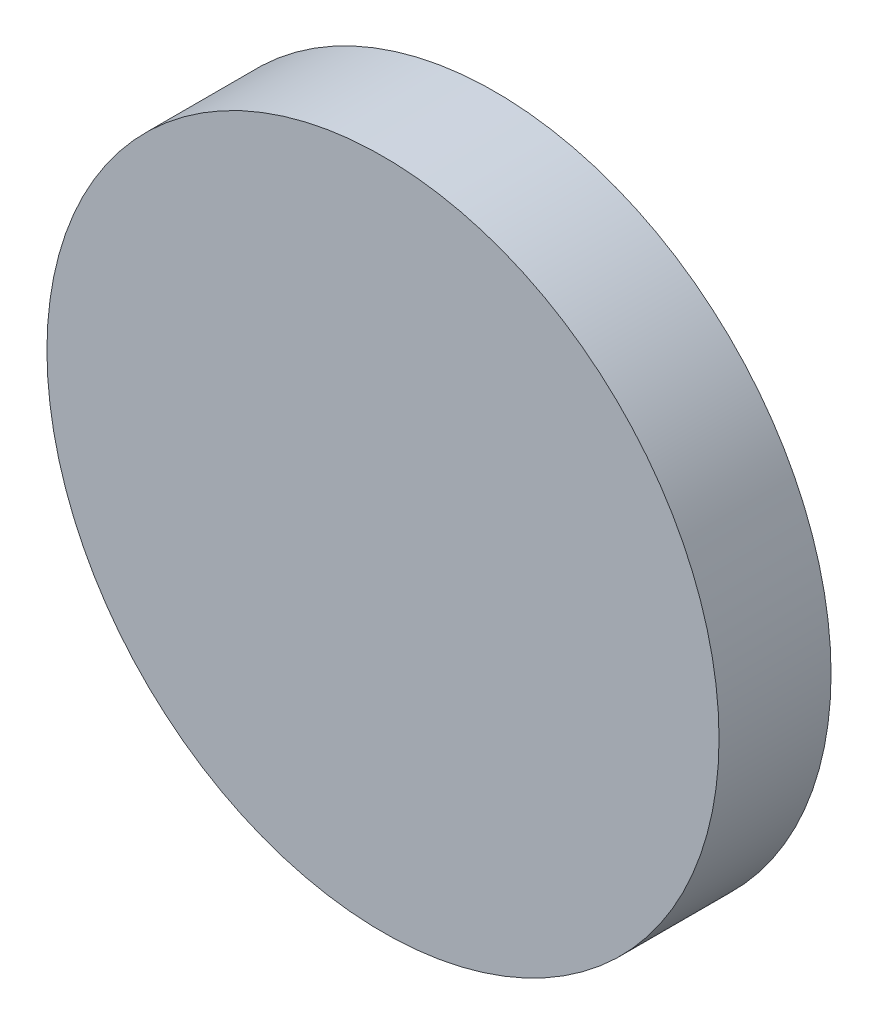
ISO-10303-21;
HEADER;
FILE_DESCRIPTION(('STEP AP214'),'2;1');
FILE_NAME('part.step','',(''),(''),'','','');
FILE_SCHEMA(('AUTOMOTIVE_DESIGN { 1 0 10303 214 1 1 1 1 }'));
ENDSEC;
DATA;
#1=APPLICATION_CONTEXT('core data for automotive mechanical design processes');
#2=APPLICATION_PROTOCOL_DEFINITION('international standard','automotive_design',2000,#1);
#3=PRODUCT_CONTEXT('',#1,'mechanical');
#4=PRODUCT('Part','Part','',(#3));
#5=PRODUCT_RELATED_PRODUCT_CATEGORY('part','',(#4));
#6=PRODUCT_DEFINITION_FORMATION('','',#4);
#7=PRODUCT_DEFINITION_CONTEXT('part definition',#1,'design');
#8=PRODUCT_DEFINITION('design','',#6,#7);
#9=PRODUCT_DEFINITION_SHAPE('','',#8);
#10=(LENGTH_UNIT() NAMED_UNIT(*) SI_UNIT(.MILLI.,.METRE.));
#11=(NAMED_UNIT(*) PLANE_ANGLE_UNIT() SI_UNIT($,.RADIAN.));
#12=(NAMED_UNIT(*) SI_UNIT($,.STERADIAN.) SOLID_ANGLE_UNIT());
#13=UNCERTAINTY_MEASURE_WITH_UNIT(LENGTH_MEASURE(1.E-05),#10,'distance_accuracy_value','');
#14=(GEOMETRIC_REPRESENTATION_CONTEXT(3) GLOBAL_UNCERTAINTY_ASSIGNED_CONTEXT((#13)) GLOBAL_UNIT_ASSIGNED_CONTEXT((#10,
#11,#12)) REPRESENTATION_CONTEXT('',''));
#15=CARTESIAN_POINT('',(0.,0.,0.));
#16=DIRECTION('',(0.,0.,1.));
#17=DIRECTION('',(1.,0.,0.));
#18=AXIS2_PLACEMENT_3D('',#15,#16,#17);
#19=CARTESIAN_POINT('',(0.,0.,2.));
#20=DIRECTION('',(0.,0.,-1.));
#21=DIRECTION('',(-1.,0.,0.));
#22=AXIS2_PLACEMENT_3D('',#19,#20,#21);
#23=CYLINDRICAL_SURFACE('',#22,6.);
#24=CARTESIAN_POINT('',(0.,0.,2.));
#25=DIRECTION('',(0.,0.,1.));
#26=DIRECTION('',(1.,0.,0.));
#27=AXIS2_PLACEMENT_3D('',#24,#25,#26);
#28=CIRCLE('',#27,6.);
#29=CARTESIAN_POINT('',(6.,0.,2.));
#30=VERTEX_POINT('',#29);
#31=EDGE_CURVE('E10',#30,#30,#28,.T.);
#32=ORIENTED_EDGE('',*,*,#31,.F.);
#33=EDGE_LOOP('',(#32));
#34=FACE_BOUND('',#33,.T.);
#35=CARTESIAN_POINT('',(0.,0.,0.));
#36=DIRECTION('',(0.,0.,1.));
#37=DIRECTION('',(1.,0.,0.));
#38=AXIS2_PLACEMENT_3D('',#35,#36,#37);
#39=CIRCLE('',#38,6.);
#40=CARTESIAN_POINT('',(6.,0.,0.));
#41=VERTEX_POINT('',#40);
#42=EDGE_CURVE('E40',#41,#41,#39,.T.);
#43=ORIENTED_EDGE('',*,*,#42,.T.);
#44=EDGE_LOOP('',(#43));
#45=FACE_BOUND('',#44,.T.);
#46=ADVANCED_FACE('F37',(#34,#45),#23,.T.);
#47=CARTESIAN_POINT('',(0.,0.,2.));
#48=DIRECTION('',(0.,0.,1.));
#49=DIRECTION('',(1.,0.,0.));
#50=AXIS2_PLACEMENT_3D('',#47,#48,#49);
#51=PLANE('',#50);
#52=ORIENTED_EDGE('',*,*,#31,.T.);
#53=EDGE_LOOP('',(#52));
#54=FACE_BOUND('',#53,.T.);
#55=ADVANCED_FACE('F54',(#54),#51,.T.);
#56=CARTESIAN_POINT('',(0.,0.,0.));
#57=DIRECTION('',(0.,0.,1.));
#58=DIRECTION('',(1.,0.,0.));
#59=AXIS2_PLACEMENT_3D('',#56,#57,#58);
#60=PLANE('',#59);
#61=ORIENTED_EDGE('',*,*,#42,.F.);
#62=EDGE_LOOP('',(#61));
#63=FACE_BOUND('',#62,.T.);
#64=ADVANCED_FACE('F52',(#63),#60,.F.);
#65=CLOSED_SHELL('',(#46,#55,#64));
#66=MANIFOLD_SOLID_BREP('B2',#65);
#67=ADVANCED_BREP_SHAPE_REPRESENTATION('',(#18,#66),#14);
#68=SHAPE_DEFINITION_REPRESENTATION(#9,#67);
ENDSEC;
END-ISO-10303-21;
